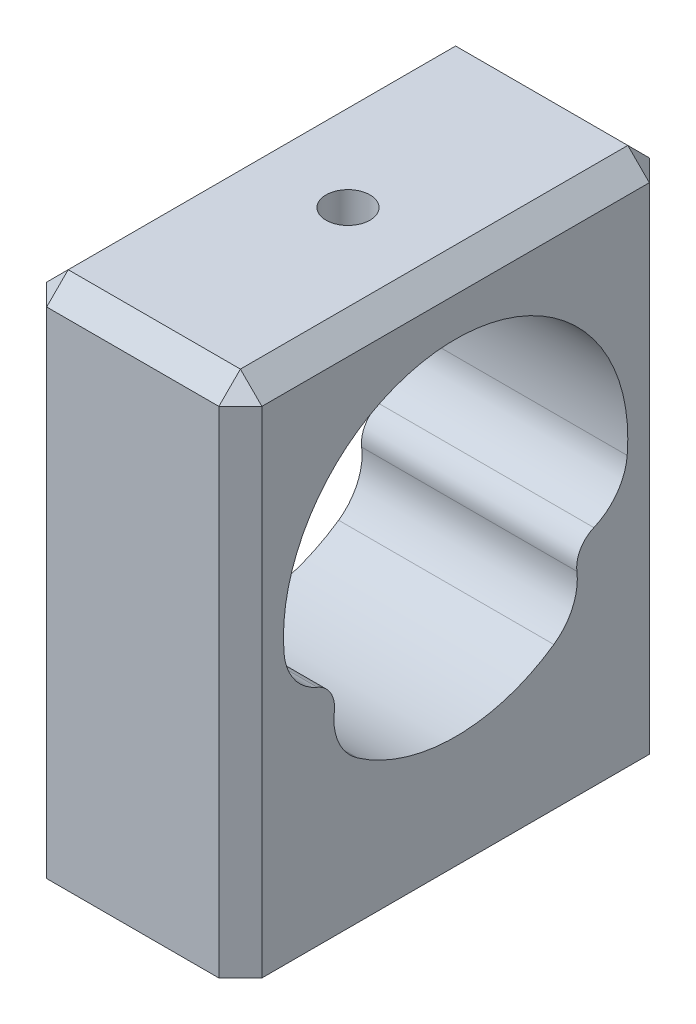
ISO-10303-21;
HEADER;
FILE_DESCRIPTION(('STEP AP214'),'2;1');
FILE_NAME('part.step','',(''),(''),'','','');
FILE_SCHEMA(('AUTOMOTIVE_DESIGN { 1 0 10303 214 1 1 1 1 }'));
ENDSEC;
DATA;
#1=APPLICATION_CONTEXT('core data for automotive mechanical design processes');
#2=APPLICATION_PROTOCOL_DEFINITION('international standard','automotive_design',2000,#1);
#3=PRODUCT_CONTEXT('',#1,'mechanical');
#4=PRODUCT('Part','Part','',(#3));
#5=PRODUCT_RELATED_PRODUCT_CATEGORY('part','',(#4));
#6=PRODUCT_DEFINITION_FORMATION('','',#4);
#7=PRODUCT_DEFINITION_CONTEXT('part definition',#1,'design');
#8=PRODUCT_DEFINITION('design','',#6,#7);
#9=PRODUCT_DEFINITION_SHAPE('','',#8);
#10=(LENGTH_UNIT() NAMED_UNIT(*) SI_UNIT(.MILLI.,.METRE.));
#11=(NAMED_UNIT(*) PLANE_ANGLE_UNIT() SI_UNIT($,.RADIAN.));
#12=(NAMED_UNIT(*) SI_UNIT($,.STERADIAN.) SOLID_ANGLE_UNIT());
#13=UNCERTAINTY_MEASURE_WITH_UNIT(LENGTH_MEASURE(1.E-05),#10,'distance_accuracy_value','');
#14=(GEOMETRIC_REPRESENTATION_CONTEXT(3) GLOBAL_UNCERTAINTY_ASSIGNED_CONTEXT((#13)) GLOBAL_UNIT_ASSIGNED_CONTEXT((#10,
#11,#12)) REPRESENTATION_CONTEXT('',''));
#15=CARTESIAN_POINT('',(0.,0.,0.));
#16=DIRECTION('',(0.,0.,1.));
#17=DIRECTION('',(1.,0.,0.));
#18=AXIS2_PLACEMENT_3D('',#15,#16,#17);
#19=CARTESIAN_POINT('',(25.,42.7979601867363,0.));
#20=DIRECTION('',(0.,-1.,0.));
#21=DIRECTION('',(0.,0.,-1.));
#22=AXIS2_PLACEMENT_3D('',#19,#20,#21);
#23=PLANE('',#22);
#24=CARTESIAN_POINT('',(12.5,42.7979601867363,0.0466317490754796));
#25=DIRECTION('',(0.,1.,0.));
#26=DIRECTION('',(0.,0.,1.));
#27=AXIS2_PLACEMENT_3D('',#24,#25,#26);
#28=CIRCLE('',#27,2.5527);
#29=CARTESIAN_POINT('',(12.5,42.7979601867363,2.59933174907548));
#30=VERTEX_POINT('',#29);
#31=EDGE_CURVE('E190',#30,#30,#28,.T.);
#32=ORIENTED_EDGE('',*,*,#31,.F.);
#33=EDGE_LOOP('',(#32));
#34=FACE_BOUND('',#33,.T.);
#35=DIRECTION('',(0.,0.,-1.));
#36=VECTOR('',#35,1.);
#37=CARTESIAN_POINT('',(22.5,42.7979601867363,-24.9533682509245));
#38=LINE('',#37,#36);
#39=CARTESIAN_POINT('',(22.5,42.7979601867363,22.5466317490755));
#40=VERTEX_POINT('',#39);
#41=CARTESIAN_POINT('',(22.5,42.7979601867363,-22.4533682509245));
#42=VERTEX_POINT('',#41);
#43=EDGE_CURVE('E343',#40,#42,#38,.T.);
#44=ORIENTED_EDGE('',*,*,#43,.T.);
#45=DIRECTION('',(-1.,0.,0.));
#46=VECTOR('',#45,1.);
#47=CARTESIAN_POINT('',(0.,42.7979601867363,-22.4533682509245));
#48=LINE('',#47,#46);
#49=CARTESIAN_POINT('',(2.5,42.7979601867363,-22.4533682509245));
#50=VERTEX_POINT('',#49);
#51=EDGE_CURVE('E11',#42,#50,#48,.T.);
#52=ORIENTED_EDGE('',*,*,#51,.T.);
#53=DIRECTION('',(0.,0.,1.));
#54=VECTOR('',#53,1.);
#55=CARTESIAN_POINT('',(2.5,42.7979601867363,0.));
#56=LINE('',#55,#54);
#57=CARTESIAN_POINT('',(2.5,42.7979601867363,22.5466317490755));
#58=VERTEX_POINT('',#57);
#59=EDGE_CURVE('E46',#50,#58,#56,.T.);
#60=ORIENTED_EDGE('',*,*,#59,.T.);
#61=DIRECTION('',(1.,0.,0.));
#62=VECTOR('',#61,1.);
#63=CARTESIAN_POINT('',(25.,42.7979601867363,22.5466317490755));
#64=LINE('',#63,#62);
#65=EDGE_CURVE('E345',#58,#40,#64,.T.);
#66=ORIENTED_EDGE('',*,*,#65,.T.);
#67=EDGE_LOOP('',(#44,#52,#60,#66));
#68=FACE_BOUND('',#67,.T.);
#69=ADVANCED_FACE('F37',(#34,#68),#23,.F.);
#70=CARTESIAN_POINT('',(25.,0.,25.0466317490755));
#71=DIRECTION('',(0.,0.,-1.));
#72=DIRECTION('',(0.,1.,0.));
#73=AXIS2_PLACEMENT_3D('',#70,#71,#72);
#74=PLANE('',#73);
#75=DIRECTION('',(-1.,0.,0.));
#76=VECTOR('',#75,1.);
#77=CARTESIAN_POINT('',(25.,40.2979601867363,25.0466317490755));
#78=LINE('',#77,#76);
#79=CARTESIAN_POINT('',(22.5,40.2979601867363,25.0466317490755));
#80=VERTEX_POINT('',#79);
#81=CARTESIAN_POINT('',(2.5,40.2979601867363,25.0466317490755));
#82=VERTEX_POINT('',#81);
#83=EDGE_CURVE('E337',#80,#82,#78,.T.);
#84=ORIENTED_EDGE('',*,*,#83,.T.);
#85=DIRECTION('',(0.,-1.,0.));
#86=VECTOR('',#85,1.);
#87=CARTESIAN_POINT('',(2.5,0.,25.0466317490755));
#88=LINE('',#87,#86);
#89=CARTESIAN_POINT('',(2.5,-17.2020398132637,25.0466317490755));
#90=VERTEX_POINT('',#89);
#91=EDGE_CURVE('E341',#82,#90,#88,.T.);
#92=ORIENTED_EDGE('',*,*,#91,.T.);
#93=DIRECTION('',(-1.,0.,0.));
#94=VECTOR('',#93,1.);
#95=CARTESIAN_POINT('',(25.,-17.2020398132637,25.0466317490755));
#96=LINE('',#95,#94);
#97=CARTESIAN_POINT('',(22.5,-17.2020398132637,25.0466317490755));
#98=VERTEX_POINT('',#97);
#99=EDGE_CURVE('E400',#98,#90,#96,.T.);
#100=ORIENTED_EDGE('',*,*,#99,.F.);
#101=DIRECTION('',(0.,1.,0.));
#102=VECTOR('',#101,1.);
#103=CARTESIAN_POINT('',(22.5,42.7979601867363,25.0466317490755));
#104=LINE('',#103,#102);
#105=EDGE_CURVE('E339',#98,#80,#104,.T.);
#106=ORIENTED_EDGE('',*,*,#105,.T.);
#107=EDGE_LOOP('',(#84,#92,#100,#106));
#108=FACE_BOUND('',#107,.T.);
#109=ADVANCED_FACE('F223',(#108),#74,.F.);
#110=CARTESIAN_POINT('',(25.,-17.2020398132637,0.));
#111=DIRECTION('',(0.,-1.,0.));
#112=DIRECTION('',(0.,0.,-1.));
#113=AXIS2_PLACEMENT_3D('',#110,#111,#112);
#114=PLANE('',#113);
#115=CARTESIAN_POINT('',(12.5,-17.2020398132637,15.0466317490755));
#116=DIRECTION('',(0.,-1.,0.));
#117=DIRECTION('',(0.,0.,-1.));
#118=AXIS2_PLACEMENT_3D('',#115,#116,#117);
#119=CIRCLE('',#118,3.17499999999999);
#120=CARTESIAN_POINT('',(12.5,-17.2020398132637,11.8716317490755));
#121=VERTEX_POINT('',#120);
#122=EDGE_CURVE('E180',#121,#121,#119,.T.);
#123=ORIENTED_EDGE('',*,*,#122,.F.);
#124=EDGE_LOOP('',(#123));
#125=FACE_BOUND('',#124,.T.);
#126=CARTESIAN_POINT('',(12.5,-17.2020398132637,-14.9533682509245));
#127=DIRECTION('',(0.,-1.,0.));
#128=DIRECTION('',(0.,0.,-1.));
#129=AXIS2_PLACEMENT_3D('',#126,#127,#128);
#130=CIRCLE('',#129,3.17499999999999);
#131=CARTESIAN_POINT('',(12.5,-17.2020398132637,-18.1283682509245));
#132=VERTEX_POINT('',#131);
#133=EDGE_CURVE('E179',#132,#132,#130,.T.);
#134=ORIENTED_EDGE('',*,*,#133,.F.);
#135=EDGE_LOOP('',(#134));
#136=FACE_BOUND('',#135,.T.);
#137=DIRECTION('',(-1.,0.,0.));
#138=VECTOR('',#137,1.);
#139=CARTESIAN_POINT('',(25.,-17.2020398132637,-24.9533682509245));
#140=LINE('',#139,#138);
#141=CARTESIAN_POINT('',(22.5,-17.2020398132637,-24.9533682509245));
#142=VERTEX_POINT('',#141);
#143=CARTESIAN_POINT('',(2.5,-17.2020398132637,-24.9533682509245));
#144=VERTEX_POINT('',#143);
#145=EDGE_CURVE('E397',#142,#144,#140,.T.);
#146=ORIENTED_EDGE('',*,*,#145,.F.);
#147=DIRECTION('',(-0.707106781186548,0.,-0.707106781186548));
#148=VECTOR('',#147,1.);
#149=CARTESIAN_POINT('',(36.2266841254623,-17.2020398132637,-11.2266841254623));
#150=LINE('',#149,#148);
#151=CARTESIAN_POINT('',(25.,-17.2020398132637,-22.4533682509245));
#152=VERTEX_POINT('',#151);
#153=EDGE_CURVE('E435',#142,#152,#150,.F.);
#154=ORIENTED_EDGE('',*,*,#153,.T.);
#155=DIRECTION('',(0.,0.,1.));
#156=VECTOR('',#155,1.);
#157=CARTESIAN_POINT('',(25.,-17.2020398132637,0.));
#158=LINE('',#157,#156);
#159=CARTESIAN_POINT('',(25.,-17.2020398132637,22.5466317490755));
#160=VERTEX_POINT('',#159);
#161=EDGE_CURVE('E377',#152,#160,#158,.T.);
#162=ORIENTED_EDGE('',*,*,#161,.T.);
#163=DIRECTION('',(-0.707106781186548,0.,0.707106781186548));
#164=VECTOR('',#163,1.);
#165=CARTESIAN_POINT('',(36.2733158745378,-17.2020398132637,11.2733158745377));
#166=LINE('',#165,#164);
#167=EDGE_CURVE('E429',#160,#98,#166,.T.);
#168=ORIENTED_EDGE('',*,*,#167,.T.);
#169=ORIENTED_EDGE('',*,*,#99,.T.);
#170=DIRECTION('',(0.707106781186548,0.,0.707106781186548));
#171=VECTOR('',#170,1.);
#172=CARTESIAN_POINT('',(1.22668412546225,-17.2020398132637,23.7733158745377));
#173=LINE('',#172,#171);
#174=CARTESIAN_POINT('',(0.,-17.2020398132637,22.5466317490755));
#175=VERTEX_POINT('',#174);
#176=EDGE_CURVE('E431',#90,#175,#173,.F.);
#177=ORIENTED_EDGE('',*,*,#176,.T.);
#178=DIRECTION('',(0.,0.,1.));
#179=VECTOR('',#178,1.);
#180=CARTESIAN_POINT('',(0.,-17.2020398132637,0.));
#181=LINE('',#180,#179);
#182=CARTESIAN_POINT('',(0.,-17.2020398132637,-22.4533682509245));
#183=VERTEX_POINT('',#182);
#184=EDGE_CURVE('E394',#183,#175,#181,.T.);
#185=ORIENTED_EDGE('',*,*,#184,.F.);
#186=DIRECTION('',(0.707106781186548,0.,-0.707106781186548));
#187=VECTOR('',#186,1.);
#188=CARTESIAN_POINT('',(1.27331587453774,-17.2020398132637,-23.7266841254623));
#189=LINE('',#188,#187);
#190=EDGE_CURVE('E433',#183,#144,#189,.T.);
#191=ORIENTED_EDGE('',*,*,#190,.T.);
#192=EDGE_LOOP('',(#146,#154,#162,#168,#169,#177,#185,#191));
#193=FACE_BOUND('',#192,.T.);
#194=ADVANCED_FACE('F229',(#125,#136,#193),#114,.T.);
#195=CARTESIAN_POINT('',(25.,14.6795696656829,-13.5558153477368));
#196=DIRECTION('',(-1.,0.,0.));
#197=DIRECTION('',(0.,0.,1.));
#198=AXIS2_PLACEMENT_3D('',#195,#196,#197);
#199=CYLINDRICAL_SURFACE('',#198,6.35);
#200=CARTESIAN_POINT('',(0.,14.6795696656829,-13.5558153477368));
#201=DIRECTION('',(1.,0.,0.));
#202=DIRECTION('',(0.,0.,-1.));
#203=AXIS2_PLACEMENT_3D('',#200,#201,#202);
#204=CIRCLE('',#203,6.35);
#205=CARTESIAN_POINT('',(0.,14.1499887273174,-19.8836936674992));
#206=VERTEX_POINT('',#205);
#207=CARTESIAN_POINT('',(0.,8.82408369364222,-16.0125986168175));
#208=VERTEX_POINT('',#207);
#209=EDGE_CURVE('E368',#206,#208,#204,.F.);
#210=ORIENTED_EDGE('',*,*,#209,.T.);
#211=DIRECTION('',(-1.,0.,0.));
#212=VECTOR('',#211,1.);
#213=CARTESIAN_POINT('',(25.,8.82408369364222,-16.0125986168175));
#214=LINE('',#213,#212);
#215=CARTESIAN_POINT('',(25.,8.82408369364222,-16.0125986168175));
#216=VERTEX_POINT('',#215);
#217=EDGE_CURVE('E401',#216,#208,#214,.T.);
#218=ORIENTED_EDGE('',*,*,#217,.F.);
#219=CARTESIAN_POINT('',(25.,14.6795696656829,-13.5558153477368));
#220=DIRECTION('',(1.,0.,0.));
#221=DIRECTION('',(0.,0.,-1.));
#222=AXIS2_PLACEMENT_3D('',#219,#220,#221);
#223=CIRCLE('',#222,6.35);
#224=CARTESIAN_POINT('',(25.,14.1499887273174,-19.8836936674992));
#225=VERTEX_POINT('',#224);
#226=EDGE_CURVE('E201',#225,#216,#223,.F.);
#227=ORIENTED_EDGE('',*,*,#226,.F.);
#228=DIRECTION('',(-1.,0.,0.));
#229=VECTOR('',#228,1.);
#230=CARTESIAN_POINT('',(25.,14.1499887273174,-19.8836936674992));
#231=LINE('',#230,#229);
#232=EDGE_CURVE('E405',#225,#206,#231,.T.);
#233=ORIENTED_EDGE('',*,*,#232,.T.);
#234=EDGE_LOOP('',(#210,#218,#227,#233));
#235=FACE_BOUND('',#234,.T.);
#236=ADVANCED_FACE('F260',(#235),#199,.F.);
#237=CARTESIAN_POINT('',(25.,5.81796018673631,-17.2738763266133));
#238=DIRECTION('',(-1.,0.,0.));
#239=DIRECTION('',(0.,0.,1.));
#240=AXIS2_PLACEMENT_3D('',#237,#238,#239);
#241=CYLINDRICAL_SURFACE('',#240,3.26);
#242=CARTESIAN_POINT('',(0.,5.81796018673631,-17.2738763266133));
#243=DIRECTION('',(1.,0.,0.));
#244=DIRECTION('',(0.,0.,-1.));
#245=AXIS2_PLACEMENT_3D('',#242,#243,#244);
#246=CIRCLE('',#245,3.26);
#247=CARTESIAN_POINT('',(0.,5.40719697119355,-14.0398581478213));
#248=VERTEX_POINT('',#247);
#249=EDGE_CURVE('E370',#208,#248,#246,.T.);
#250=ORIENTED_EDGE('',*,*,#249,.T.);
#251=DIRECTION('',(-1.,0.,0.));
#252=VECTOR('',#251,1.);
#253=CARTESIAN_POINT('',(25.,5.40719697119355,-14.0398581478213));
#254=LINE('',#253,#252);
#255=CARTESIAN_POINT('',(25.,5.40719697119355,-14.0398581478213));
#256=VERTEX_POINT('',#255);
#257=EDGE_CURVE('E418',#256,#248,#254,.T.);
#258=ORIENTED_EDGE('',*,*,#257,.F.);
#259=CARTESIAN_POINT('',(25.,5.81796018673631,-17.2738763266133));
#260=DIRECTION('',(1.,0.,0.));
#261=DIRECTION('',(0.,0.,-1.));
#262=AXIS2_PLACEMENT_3D('',#259,#260,#261);
#263=CIRCLE('',#262,3.26);
#264=EDGE_CURVE('E728',#216,#256,#263,.T.);
#265=ORIENTED_EDGE('',*,*,#264,.F.);
#266=ORIENTED_EDGE('',*,*,#217,.T.);
#267=EDGE_LOOP('',(#250,#258,#265,#266));
#268=FACE_BOUND('',#267,.T.);
#269=ADVANCED_FACE('F256',(#268),#241,.T.);
#270=CARTESIAN_POINT('',(25.,4.60709070778971,-7.74046690999034));
#271=DIRECTION('',(-1.,0.,0.));
#272=DIRECTION('',(0.,0.,1.));
#273=AXIS2_PLACEMENT_3D('',#270,#271,#272);
#274=CYLINDRICAL_SURFACE('',#273,6.35);
#275=CARTESIAN_POINT('',(0.,4.60709070778971,-7.74046690999034));
#276=DIRECTION('',(1.,0.,0.));
#277=DIRECTION('',(0.,0.,-1.));
#278=AXIS2_PLACEMENT_3D('',#275,#276,#277);
#279=CIRCLE('',#278,6.35);
#280=CARTESIAN_POINT('',(0.,-0.608222199998606,-11.3630366158561));
#281=VERTEX_POINT('',#280);
#282=EDGE_CURVE('E374',#248,#281,#279,.F.);
#283=ORIENTED_EDGE('',*,*,#282,.T.);
#284=DIRECTION('',(-1.,0.,0.));
#285=VECTOR('',#284,1.);
#286=CARTESIAN_POINT('',(25.,-0.608222199998606,-11.3630366158561));
#287=LINE('',#286,#285);
#288=CARTESIAN_POINT('',(25.,-0.608222199998606,-11.3630366158561));
#289=VERTEX_POINT('',#288);
#290=EDGE_CURVE('E416',#289,#281,#287,.T.);
#291=ORIENTED_EDGE('',*,*,#290,.F.);
#292=CARTESIAN_POINT('',(25.,4.60709070778971,-7.74046690999034));
#293=DIRECTION('',(1.,0.,0.));
#294=DIRECTION('',(0.,0.,-1.));
#295=AXIS2_PLACEMENT_3D('',#292,#293,#294);
#296=CIRCLE('',#295,6.35);
#297=EDGE_CURVE('E717',#256,#289,#296,.F.);
#298=ORIENTED_EDGE('',*,*,#297,.F.);
#299=ORIENTED_EDGE('',*,*,#257,.T.);
#300=EDGE_LOOP('',(#283,#291,#298,#299));
#301=FACE_BOUND('',#300,.T.);
#302=ADVANCED_FACE('F253',(#301),#274,.F.);
#303=CARTESIAN_POINT('',(25.,15.8179601867363,0.0466317490754875));
#304=DIRECTION('',(-1.,0.,0.));
#305=DIRECTION('',(0.,0.,1.));
#306=AXIS2_PLACEMENT_3D('',#303,#304,#305);
#307=CYLINDRICAL_SURFACE('',#306,20.);
#308=CARTESIAN_POINT('',(0.,15.8179601867363,0.0466317490754875));
#309=DIRECTION('',(1.,0.,0.));
#310=DIRECTION('',(0.,0.,-1.));
#311=AXIS2_PLACEMENT_3D('',#308,#309,#310);
#312=CIRCLE('',#311,20.);
#313=CARTESIAN_POINT('',(0.,-0.608222199998613,11.4563001140071));
#314=VERTEX_POINT('',#313);
#315=EDGE_CURVE('E382',#314,#281,#312,.T.);
#316=ORIENTED_EDGE('',*,*,#315,.F.);
#317=DIRECTION('',(-1.,0.,0.));
#318=VECTOR('',#317,1.);
#319=CARTESIAN_POINT('',(25.,-0.608222199998613,11.4563001140071));
#320=LINE('',#319,#318);
#321=CARTESIAN_POINT('',(25.,-0.608222199998613,11.4563001140071));
#322=VERTEX_POINT('',#321);
#323=EDGE_CURVE('E414',#322,#314,#320,.T.);
#324=ORIENTED_EDGE('',*,*,#323,.F.);
#325=CARTESIAN_POINT('',(25.,15.8179601867363,0.0466317490754875));
#326=DIRECTION('',(1.,0.,0.));
#327=DIRECTION('',(0.,0.,-1.));
#328=AXIS2_PLACEMENT_3D('',#325,#326,#327);
#329=CIRCLE('',#328,20.);
#330=EDGE_CURVE('E713',#322,#289,#329,.T.);
#331=ORIENTED_EDGE('',*,*,#330,.T.);
#332=ORIENTED_EDGE('',*,*,#290,.T.);
#333=EDGE_LOOP('',(#316,#324,#331,#332));
#334=FACE_BOUND('',#333,.T.);
#335=ADVANCED_FACE('F241',(#334),#307,.F.);
#336=CARTESIAN_POINT('',(25.,4.60709070778971,7.8337304081413));
#337=DIRECTION('',(-1.,0.,0.));
#338=DIRECTION('',(0.,0.,1.));
#339=AXIS2_PLACEMENT_3D('',#336,#337,#338);
#340=CYLINDRICAL_SURFACE('',#339,6.35);
#341=CARTESIAN_POINT('',(0.,4.60709070778971,7.8337304081413));
#342=DIRECTION('',(1.,0.,0.));
#343=DIRECTION('',(0.,0.,-1.));
#344=AXIS2_PLACEMENT_3D('',#341,#342,#343);
#345=CIRCLE('',#344,6.35);
#346=CARTESIAN_POINT('',(0.,5.40719697119354,14.1331216459723));
#347=VERTEX_POINT('',#346);
#348=EDGE_CURVE('E385',#347,#314,#345,.T.);
#349=ORIENTED_EDGE('',*,*,#348,.F.);
#350=DIRECTION('',(-1.,0.,0.));
#351=VECTOR('',#350,1.);
#352=CARTESIAN_POINT('',(25.,5.40719697119354,14.1331216459723));
#353=LINE('',#352,#351);
#354=CARTESIAN_POINT('',(25.,5.40719697119354,14.1331216459723));
#355=VERTEX_POINT('',#354);
#356=EDGE_CURVE('E412',#355,#347,#353,.T.);
#357=ORIENTED_EDGE('',*,*,#356,.F.);
#358=CARTESIAN_POINT('',(25.,4.60709070778971,7.8337304081413));
#359=DIRECTION('',(1.,0.,0.));
#360=DIRECTION('',(0.,0.,-1.));
#361=AXIS2_PLACEMENT_3D('',#358,#359,#360);
#362=CIRCLE('',#361,6.35);
#363=EDGE_CURVE('E711',#355,#322,#362,.T.);
#364=ORIENTED_EDGE('',*,*,#363,.T.);
#365=ORIENTED_EDGE('',*,*,#323,.T.);
#366=EDGE_LOOP('',(#349,#357,#364,#365));
#367=FACE_BOUND('',#366,.T.);
#368=ADVANCED_FACE('F248',(#367),#340,.F.);
#369=CARTESIAN_POINT('',(25.,5.8179601867363,17.3671398247643));
#370=DIRECTION('',(-1.,0.,0.));
#371=DIRECTION('',(0.,0.,1.));
#372=AXIS2_PLACEMENT_3D('',#369,#370,#371);
#373=CYLINDRICAL_SURFACE('',#372,3.26);
#374=CARTESIAN_POINT('',(0.,5.8179601867363,17.3671398247643));
#375=DIRECTION('',(1.,0.,0.));
#376=DIRECTION('',(0.,0.,-1.));
#377=AXIS2_PLACEMENT_3D('',#374,#375,#376);
#378=CIRCLE('',#377,3.26);
#379=CARTESIAN_POINT('',(0.,8.82408369364221,16.1058621149685));
#380=VERTEX_POINT('',#379);
#381=EDGE_CURVE('E389',#347,#380,#378,.T.);
#382=ORIENTED_EDGE('',*,*,#381,.T.);
#383=DIRECTION('',(-1.,0.,0.));
#384=VECTOR('',#383,1.);
#385=CARTESIAN_POINT('',(25.,8.82408369364221,16.1058621149685));
#386=LINE('',#385,#384);
#387=CARTESIAN_POINT('',(25.,8.82408369364221,16.1058621149685));
#388=VERTEX_POINT('',#387);
#389=EDGE_CURVE('E409',#388,#380,#386,.T.);
#390=ORIENTED_EDGE('',*,*,#389,.F.);
#391=CARTESIAN_POINT('',(25.,5.8179601867363,17.3671398247643));
#392=DIRECTION('',(1.,0.,0.));
#393=DIRECTION('',(0.,0.,-1.));
#394=AXIS2_PLACEMENT_3D('',#391,#392,#393);
#395=CIRCLE('',#394,3.26);
#396=EDGE_CURVE('E712',#355,#388,#395,.T.);
#397=ORIENTED_EDGE('',*,*,#396,.F.);
#398=ORIENTED_EDGE('',*,*,#356,.T.);
#399=EDGE_LOOP('',(#382,#390,#397,#398));
#400=FACE_BOUND('',#399,.T.);
#401=ADVANCED_FACE('F244',(#400),#373,.T.);
#402=CARTESIAN_POINT('',(25.,14.6795696656829,13.6490788458877));
#403=DIRECTION('',(-1.,0.,0.));
#404=DIRECTION('',(0.,0.,1.));
#405=AXIS2_PLACEMENT_3D('',#402,#403,#404);
#406=CYLINDRICAL_SURFACE('',#405,6.35);
#407=CARTESIAN_POINT('',(0.,14.6795696656829,13.6490788458877));
#408=DIRECTION('',(1.,0.,0.));
#409=DIRECTION('',(0.,0.,-1.));
#410=AXIS2_PLACEMENT_3D('',#407,#408,#409);
#411=CIRCLE('',#410,6.35);
#412=CARTESIAN_POINT('',(0.,14.1499887273174,19.9769571656502));
#413=VERTEX_POINT('',#412);
#414=EDGE_CURVE('E391',#380,#413,#411,.F.);
#415=ORIENTED_EDGE('',*,*,#414,.T.);
#416=DIRECTION('',(-1.,0.,0.));
#417=VECTOR('',#416,1.);
#418=CARTESIAN_POINT('',(25.,14.1499887273174,19.9769571656502));
#419=LINE('',#418,#417);
#420=CARTESIAN_POINT('',(25.,14.1499887273174,19.9769571656502));
#421=VERTEX_POINT('',#420);
#422=EDGE_CURVE('E407',#421,#413,#419,.T.);
#423=ORIENTED_EDGE('',*,*,#422,.F.);
#424=CARTESIAN_POINT('',(25.,14.6795696656829,13.6490788458877));
#425=DIRECTION('',(1.,0.,0.));
#426=DIRECTION('',(0.,0.,-1.));
#427=AXIS2_PLACEMENT_3D('',#424,#425,#426);
#428=CIRCLE('',#427,6.35);
#429=EDGE_CURVE('E715',#388,#421,#428,.F.);
#430=ORIENTED_EDGE('',*,*,#429,.F.);
#431=ORIENTED_EDGE('',*,*,#389,.T.);
#432=EDGE_LOOP('',(#415,#423,#430,#431));
#433=FACE_BOUND('',#432,.T.);
#434=ADVANCED_FACE('F239',(#433),#406,.F.);
#435=CARTESIAN_POINT('',(12.5,35.6543843279468,2.59933174907548));
#436=CARTESIAN_POINT('',(12.3572416838352,35.6543864160402,2.59932569481596));
#437=CARTESIAN_POINT('',(12.2143947575747,35.6559420702071,2.5873158129562));
#438=CARTESIAN_POINT('',(11.9326781380449,35.6619940707854,2.53959691605681));
#439=CARTESIAN_POINT('',(11.7938127303045,35.6664934701941,2.50386329624642));
#440=CARTESIAN_POINT('',(11.5241786303058,35.6779152137445,2.40976907951242));
#441=CARTESIAN_POINT('',(11.3934044447206,35.6848358922985,2.35142403392923));
#442=CARTESIAN_POINT('',(11.1435269886496,35.7003184060576,2.21379679800134));
#443=CARTESIAN_POINT('',(11.0244217654798,35.7088799659663,2.13451811892368));
#444=CARTESIAN_POINT('',(10.8005450839868,35.7267354538854,1.9567791697767));
#445=CARTESIAN_POINT('',(10.6958514950218,35.73603296338,1.85822116572775));
#446=CARTESIAN_POINT('',(10.5044428003175,35.7542805718876,1.64493173210829));
#447=CARTESIAN_POINT('',(10.4177285978291,35.763230653428,1.53019949046038));
#448=CARTESIAN_POINT('',(10.2644600135495,35.7798117136507,1.28732798270043));
#449=CARTESIAN_POINT('',(10.1979762357245,35.787438033538,1.15914381551506));
#450=CARTESIAN_POINT('',(10.0875080387419,35.80047289575,0.893316108177442));
#451=CARTESIAN_POINT('',(10.043522750441,35.8058815237451,0.755672933670965));
#452=CARTESIAN_POINT('',(9.97953313079223,35.8138463682097,0.475631432445426));
#453=CARTESIAN_POINT('',(9.95939922671489,35.8164179914227,0.333263158367532));
#454=CARTESIAN_POINT('',(9.94328226400126,35.8184717040898,0.0471469487521629));
#455=CARTESIAN_POINT('',(9.94729821712445,35.8179539199661,-0.0966009300899311));
#456=CARTESIAN_POINT('',(9.97926328320534,35.8138996087693,-0.38051406505626));
#457=CARTESIAN_POINT('',(10.0070730394015,35.8103806594565,-0.520695297363489));
#458=CARTESIAN_POINT('',(10.0856183639764,35.8007391319719,-0.794384734157456));
#459=CARTESIAN_POINT('',(10.1363543838085,35.7946165025297,-0.927892807181938));
#460=CARTESIAN_POINT('',(10.2594596823029,35.780425281213,-1.18487660673625));
#461=CARTESIAN_POINT('',(10.3318891087609,35.7723512911127,-1.30832320990767));
#462=CARTESIAN_POINT('',(10.4962814451631,35.7551603238336,-1.54136219279759));
#463=CARTESIAN_POINT('',(10.588245288962,35.7460432968013,-1.65095390977509));
#464=CARTESIAN_POINT('',(10.7898760567982,35.7277095435735,-1.85399120044943));
#465=CARTESIAN_POINT('',(10.8996644538134,35.7184925698661,-1.94731616167771));
#466=CARTESIAN_POINT('',(11.1334109987325,35.7010617769836,-2.11423295805381));
#467=CARTESIAN_POINT('',(11.2573691945326,35.6928479611995,-2.18782472649748));
#468=CARTESIAN_POINT('',(11.5160458577234,35.678353604002,-2.31319394272881));
#469=CARTESIAN_POINT('',(11.6507691886575,35.6720739427043,-2.36496146357091));
#470=CARTESIAN_POINT('',(11.9270947856339,35.662175888705,-2.44510434443558));
#471=CARTESIAN_POINT('',(12.0686967051427,35.6585573620871,-2.47348088157168));
#472=CARTESIAN_POINT('',(12.3536939162928,35.6544158551712,-2.50587600625001));
#473=CARTESIAN_POINT('',(12.4970695985099,35.6538712888565,-2.51006445262583));
#474=CARTESIAN_POINT('',(12.7824784792897,35.6558822497009,-2.49441292457495));
#475=CARTESIAN_POINT('',(12.924511707647,35.6584377078939,-2.47457348469537));
#476=CARTESIAN_POINT('',(13.2026931849448,35.666341071556,-2.41157247330073));
#477=CARTESIAN_POINT('',(13.3388604181787,35.6716790992523,-2.36849338088118));
#478=CARTESIAN_POINT('',(13.6020389878373,35.6845381181353,-2.26032091107954));
#479=CARTESIAN_POINT('',(13.7290499894332,35.6920591891018,-2.1952267291359));
#480=CARTESIAN_POINT('',(13.9710785302592,35.7084884828329,-2.04445516238085));
#481=CARTESIAN_POINT('',(14.0860262553728,35.7174041081982,-1.95866652719721));
#482=CARTESIAN_POINT('',(14.2999524482009,35.7355947948682,-1.76909828900279));
#483=CARTESIAN_POINT('',(14.3989302674236,35.7448698707502,-1.66531795575592));
#484=CARTESIAN_POINT('',(14.5787050120353,35.7628008117464,-1.44196966246262));
#485=CARTESIAN_POINT('',(14.6593902294864,35.7714526631571,-1.32231141940448));
#486=CARTESIAN_POINT('',(14.7995159492519,35.7871020817889,-1.07104223216181));
#487=CARTESIAN_POINT('',(14.8589568953103,35.7940996835624,-0.939431537708527));
#488=CARTESIAN_POINT('',(14.9547228726095,35.8056343694458,-0.668362405468719));
#489=CARTESIAN_POINT('',(14.9911121235313,35.8101782840137,-0.528926958547922));
#490=CARTESIAN_POINT('',(15.0399505698029,35.8163220135643,-0.245863306580565));
#491=CARTESIAN_POINT('',(15.0524008930496,35.8179219672534,-0.1022352993927));
#492=CARTESIAN_POINT('',(15.0529863621073,35.8179967792272,0.184046378101164));
#493=CARTESIAN_POINT('',(15.0412936252332,35.8164937588103,0.326699721178873));
#494=CARTESIAN_POINT('',(14.9942898501224,35.8105755326181,0.607996021855116));
#495=CARTESIAN_POINT('',(14.9589788332732,35.8061603294799,0.746638983085114));
#496=CARTESIAN_POINT('',(14.8657955999484,35.7949116033192,1.01595397038597));
#497=CARTESIAN_POINT('',(14.8079319911437,35.7880790030387,1.14662901560033));
#498=CARTESIAN_POINT('',(14.6713039594966,35.7727514586304,1.3964415073055));
#499=CARTESIAN_POINT('',(14.5925392454063,35.7642564913388,1.51557879299101));
#500=CARTESIAN_POINT('',(14.4157093451146,35.7464798382693,1.73981268243374));
#501=CARTESIAN_POINT('',(14.3175161616763,35.7371931810314,1.84480796025821));
#502=CARTESIAN_POINT('',(14.1048831514595,35.718919405842,2.03689744736339));
#503=CARTESIAN_POINT('',(13.9904394864284,35.7099323592774,2.12398741560262));
#504=CARTESIAN_POINT('',(13.748024142054,35.6932367718221,2.27809570077892));
#505=CARTESIAN_POINT('',(13.6199998676877,35.6855335223865,2.34503182034493));
#506=CARTESIAN_POINT('',(13.3544997585376,35.6723397169244,2.45635874255538));
#507=CARTESIAN_POINT('',(13.2170343422268,35.6668467663014,2.50077395757705));
#508=CARTESIAN_POINT('',(12.9823884171539,35.6600230072519,2.55521809512678));
#509=CARTESIAN_POINT('',(12.8866852474625,35.6579190981779,2.57173678147051));
#510=CARTESIAN_POINT('',(12.6940016874741,35.6550990545534,2.59379562157866));
#511=CARTESIAN_POINT('',(12.5970213074588,35.6543829088382,2.59933586366711));
#512=CARTESIAN_POINT('',(12.5,35.6543843279468,2.59933174907548));
#513=B_SPLINE_CURVE_WITH_KNOTS('',3,(#435,#436,#437,#438,#439,#440,#441,#442,#443,#444,#445,
#446,#447,#448,#449,#450,#451,#452,#453,#454,#455,#456,#457,#458,#459,#460,#461,#462,#463,#464,
#465,#466,#467,#468,#469,#470,#471,#472,#473,#474,#475,#476,#477,#478,#479,#480,#481,#482,#483,
#484,#485,#486,#487,#488,#489,#490,#491,#492,#493,#494,#495,#496,#497,#498,#499,#500,#501,#502,
#503,#504,#505,#506,#507,#508,#509,#510,#511,#512),.UNSPECIFIED.,.T.,.F.,(4,2,2,2,2,2,2,2,2,2,2,
2,2,2,2,2,2,2,2,2,2,2,2,2,2,2,2,2,2,2,2,2,2,2,2,2,2,2,4),(0.,0.427920495817666,
0.856285498656758,1.28435640851927,1.71235556220394,2.14258342187768,2.57283289016431,
3.00456714336972,3.4362847169076,3.86564606818972,4.29498984962056,4.72183610817693,
5.14869077235819,5.57674007859641,6.00480985260089,6.43592981002201,6.86705122474017,
7.29836852769152,7.72966412396981,8.15792726501564,8.58618087868894,9.01292449563774,
9.43968371000753,9.86879035471947,10.2979144198296,10.7295923839857,11.1612613308546,
11.5917223410101,12.0221630692405,12.449545757114,12.8769280579737,13.3041473988761,
13.7313726932093,14.1615124036642,14.5917538796893,15.0237270375294,15.4552309354597,
15.7460563047192,16.0368793342142),.UNSPECIFIED.);
#514=CARTESIAN_POINT('',(12.5,35.6543843279468,2.59933174907548));
#515=VERTEX_POINT('',#514);
#516=EDGE_CURVE('E193',#515,#515,#513,.T.);
#517=ORIENTED_EDGE('',*,*,#516,.F.);
#518=EDGE_LOOP('',(#517));
#519=FACE_BOUND('',#518,.T.);
#520=EDGE_CURVE('E386',#206,#413,#312,.T.);
#521=ORIENTED_EDGE('',*,*,#520,.F.);
#522=ORIENTED_EDGE('',*,*,#232,.F.);
#523=EDGE_CURVE('E451',#225,#421,#329,.T.);
#524=ORIENTED_EDGE('',*,*,#523,.T.);
#525=ORIENTED_EDGE('',*,*,#422,.T.);
#526=EDGE_LOOP('',(#521,#522,#524,#525));
#527=FACE_BOUND('',#526,.T.);
#528=ADVANCED_FACE('F235',(#519,#527),#307,.F.);
#529=CARTESIAN_POINT('',(25.,0.,-24.9533682509245));
#530=DIRECTION('',(0.,0.,-1.));
#531=DIRECTION('',(0.,1.,0.));
#532=AXIS2_PLACEMENT_3D('',#529,#530,#531);
#533=PLANE('',#532);
#534=DIRECTION('',(1.,0.,0.));
#535=VECTOR('',#534,1.);
#536=CARTESIAN_POINT('',(25.,40.2979601867363,-24.9533682509245));
#537=LINE('',#536,#535);
#538=CARTESIAN_POINT('',(2.5,40.2979601867363,-24.9533682509245));
#539=VERTEX_POINT('',#538);
#540=CARTESIAN_POINT('',(22.5,40.2979601867363,-24.9533682509245));
#541=VERTEX_POINT('',#540);
#542=EDGE_CURVE('E404',#539,#541,#537,.T.);
#543=ORIENTED_EDGE('',*,*,#542,.T.);
#544=DIRECTION('',(0.,-1.,0.));
#545=VECTOR('',#544,1.);
#546=CARTESIAN_POINT('',(22.5,0.,-24.9533682509245));
#547=LINE('',#546,#545);
#548=EDGE_CURVE('E426',#541,#142,#547,.T.);
#549=ORIENTED_EDGE('',*,*,#548,.T.);
#550=ORIENTED_EDGE('',*,*,#145,.T.);
#551=DIRECTION('',(0.,1.,0.));
#552=VECTOR('',#551,1.);
#553=CARTESIAN_POINT('',(2.5,42.7979601867363,-24.9533682509245));
#554=LINE('',#553,#552);
#555=EDGE_CURVE('E424',#144,#539,#554,.T.);
#556=ORIENTED_EDGE('',*,*,#555,.T.);
#557=EDGE_LOOP('',(#543,#549,#550,#556));
#558=FACE_BOUND('',#557,.T.);
#559=ADVANCED_FACE('F238',(#558),#533,.T.);
#560=CARTESIAN_POINT('',(25.,0.,0.));
#561=DIRECTION('',(1.,0.,0.));
#562=DIRECTION('',(0.,0.,-1.));
#563=AXIS2_PLACEMENT_3D('',#560,#561,#562);
#564=PLANE('',#563);
#565=ORIENTED_EDGE('',*,*,#161,.F.);
#566=DIRECTION('',(0.,1.,0.));
#567=VECTOR('',#566,1.);
#568=CARTESIAN_POINT('',(25.,0.,-22.4533682509245));
#569=LINE('',#568,#567);
#570=CARTESIAN_POINT('',(25.,40.2979601867363,-22.4533682509245));
#571=VERTEX_POINT('',#570);
#572=EDGE_CURVE('E328',#152,#571,#569,.T.);
#573=ORIENTED_EDGE('',*,*,#572,.T.);
#574=DIRECTION('',(0.,0.,1.));
#575=VECTOR('',#574,1.);
#576=CARTESIAN_POINT('',(25.,40.2979601867363,25.0466317490755));
#577=LINE('',#576,#575);
#578=CARTESIAN_POINT('',(25.,40.2979601867363,22.5466317490755));
#579=VERTEX_POINT('',#578);
#580=EDGE_CURVE('E437',#571,#579,#577,.T.);
#581=ORIENTED_EDGE('',*,*,#580,.T.);
#582=DIRECTION('',(0.,-1.,0.));
#583=VECTOR('',#582,1.);
#584=CARTESIAN_POINT('',(25.,-17.2020398132637,22.5466317490755));
#585=LINE('',#584,#583);
#586=EDGE_CURVE('E332',#579,#160,#585,.T.);
#587=ORIENTED_EDGE('',*,*,#586,.T.);
#588=EDGE_LOOP('',(#565,#573,#581,#587));
#589=FACE_BOUND('',#588,.T.);
#590=ORIENTED_EDGE('',*,*,#226,.T.);
#591=ORIENTED_EDGE('',*,*,#264,.T.);
#592=ORIENTED_EDGE('',*,*,#297,.T.);
#593=ORIENTED_EDGE('',*,*,#330,.F.);
#594=ORIENTED_EDGE('',*,*,#363,.F.);
#595=ORIENTED_EDGE('',*,*,#396,.T.);
#596=ORIENTED_EDGE('',*,*,#429,.T.);
#597=ORIENTED_EDGE('',*,*,#523,.F.);
#598=EDGE_LOOP('',(#590,#591,#592,#593,#594,#595,#596,#597));
#599=FACE_BOUND('',#598,.T.);
#600=ADVANCED_FACE('F442',(#589,#599),#564,.T.);
#601=CARTESIAN_POINT('',(0.,0.,0.));
#602=DIRECTION('',(1.,0.,0.));
#603=DIRECTION('',(0.,0.,-1.));
#604=AXIS2_PLACEMENT_3D('',#601,#602,#603);
#605=PLANE('',#604);
#606=ORIENTED_EDGE('',*,*,#209,.F.);
#607=ORIENTED_EDGE('',*,*,#520,.T.);
#608=ORIENTED_EDGE('',*,*,#414,.F.);
#609=ORIENTED_EDGE('',*,*,#381,.F.);
#610=ORIENTED_EDGE('',*,*,#348,.T.);
#611=ORIENTED_EDGE('',*,*,#315,.T.);
#612=ORIENTED_EDGE('',*,*,#282,.F.);
#613=ORIENTED_EDGE('',*,*,#249,.F.);
#614=EDGE_LOOP('',(#606,#607,#608,#609,#610,#611,#612,#613));
#615=FACE_BOUND('',#614,.T.);
#616=DIRECTION('',(0.,0.,-1.));
#617=VECTOR('',#616,1.);
#618=CARTESIAN_POINT('',(0.,40.2979601867363,0.));
#619=LINE('',#618,#617);
#620=CARTESIAN_POINT('',(0.,40.2979601867363,22.5466317490755));
#621=VERTEX_POINT('',#620);
#622=CARTESIAN_POINT('',(0.,40.2979601867363,-22.4533682509245));
#623=VERTEX_POINT('',#622);
#624=EDGE_CURVE('E322',#621,#623,#619,.T.);
#625=ORIENTED_EDGE('',*,*,#624,.T.);
#626=DIRECTION('',(0.,-1.,0.));
#627=VECTOR('',#626,1.);
#628=CARTESIAN_POINT('',(0.,-17.2020398132637,-22.4533682509245));
#629=LINE('',#628,#627);
#630=EDGE_CURVE('E330',#623,#183,#629,.T.);
#631=ORIENTED_EDGE('',*,*,#630,.T.);
#632=ORIENTED_EDGE('',*,*,#184,.T.);
#633=DIRECTION('',(0.,1.,0.));
#634=VECTOR('',#633,1.);
#635=CARTESIAN_POINT('',(0.,0.,22.5466317490755));
#636=LINE('',#635,#634);
#637=EDGE_CURVE('E327',#175,#621,#636,.T.);
#638=ORIENTED_EDGE('',*,*,#637,.T.);
#639=EDGE_LOOP('',(#625,#631,#632,#638));
#640=FACE_BOUND('',#639,.T.);
#641=ADVANCED_FACE('F308',(#615,#640),#605,.F.);
#642=CARTESIAN_POINT('',(2.5,0.,25.0466317490755));
#643=DIRECTION('',(0.707106781186547,0.,-0.707106781186547));
#644=DIRECTION('',(0.,-1.,0.));
#645=AXIS2_PLACEMENT_3D('',#642,#643,#644);
#646=PLANE('',#645);
#647=DIRECTION('',(-0.707106781186548,0.,-0.707106781186548));
#648=VECTOR('',#647,1.);
#649=CARTESIAN_POINT('',(0.,40.2979601867363,22.5466317490755));
#650=LINE('',#649,#648);
#651=EDGE_CURVE('E41',#621,#82,#650,.F.);
#652=ORIENTED_EDGE('',*,*,#651,.F.);
#653=ORIENTED_EDGE('',*,*,#637,.F.);
#654=ORIENTED_EDGE('',*,*,#176,.F.);
#655=ORIENTED_EDGE('',*,*,#91,.F.);
#656=EDGE_LOOP('',(#652,#653,#654,#655));
#657=FACE_BOUND('',#656,.T.);
#658=ADVANCED_FACE('F39',(#657),#646,.F.);
#659=CARTESIAN_POINT('',(0.,40.2979601867363,22.5466317490755));
#660=DIRECTION('',(-0.577350269189627,0.577350269189625,0.577350269189626));
#661=DIRECTION('',(0.707106781186546,0.,0.707106781186548));
#662=AXIS2_PLACEMENT_3D('',#659,#660,#661);
#663=PLANE('',#662);
#664=DIRECTION('',(0.707106781186547,0.707106781186547,0.));
#665=VECTOR('',#664,1.);
#666=CARTESIAN_POINT('',(0.,40.2979601867363,22.5466317490755));
#667=LINE('',#666,#665);
#668=EDGE_CURVE('E313',#621,#58,#667,.T.);
#669=ORIENTED_EDGE('',*,*,#668,.F.);
#670=ORIENTED_EDGE('',*,*,#651,.T.);
#671=DIRECTION('',(0.,-0.707106781186548,0.707106781186548));
#672=VECTOR('',#671,1.);
#673=CARTESIAN_POINT('',(2.5,41.5479601867363,23.7966317490755));
#674=LINE('',#673,#672);
#675=EDGE_CURVE('E317',#58,#82,#674,.T.);
#676=ORIENTED_EDGE('',*,*,#675,.F.);
#677=EDGE_LOOP('',(#669,#670,#676));
#678=FACE_BOUND('',#677,.T.);
#679=ADVANCED_FACE('F301',(#678),#663,.T.);
#680=CARTESIAN_POINT('',(25.,0.,22.5466317490755));
#681=DIRECTION('',(0.707106781186547,0.,0.707106781186547));
#682=DIRECTION('',(0.,1.,0.));
#683=AXIS2_PLACEMENT_3D('',#680,#681,#682);
#684=PLANE('',#683);
#685=ORIENTED_EDGE('',*,*,#167,.F.);
#686=ORIENTED_EDGE('',*,*,#586,.F.);
#687=DIRECTION('',(0.707106781186548,0.,-0.707106781186548));
#688=VECTOR('',#687,1.);
#689=CARTESIAN_POINT('',(22.5,40.2979601867363,25.0466317490755));
#690=LINE('',#689,#688);
#691=EDGE_CURVE('E319',#80,#579,#690,.T.);
#692=ORIENTED_EDGE('',*,*,#691,.F.);
#693=ORIENTED_EDGE('',*,*,#105,.F.);
#694=EDGE_LOOP('',(#685,#686,#692,#693));
#695=FACE_BOUND('',#694,.T.);
#696=ADVANCED_FACE('F298',(#695),#684,.T.);
#697=CARTESIAN_POINT('',(25.,40.2979601867363,25.0466317490755));
#698=DIRECTION('',(0.,-0.707106781186547,-0.707106781186547));
#699=DIRECTION('',(-1.,0.,0.));
#700=AXIS2_PLACEMENT_3D('',#697,#698,#699);
#701=PLANE('',#700);
#702=ORIENTED_EDGE('',*,*,#675,.T.);
#703=ORIENTED_EDGE('',*,*,#83,.F.);
#704=DIRECTION('',(0.,0.707106781186548,-0.707106781186548));
#705=VECTOR('',#704,1.);
#706=CARTESIAN_POINT('',(22.5,40.2979601867363,25.0466317490755));
#707=LINE('',#706,#705);
#708=EDGE_CURVE('E363',#40,#80,#707,.F.);
#709=ORIENTED_EDGE('',*,*,#708,.F.);
#710=ORIENTED_EDGE('',*,*,#65,.F.);
#711=EDGE_LOOP('',(#702,#703,#709,#710));
#712=FACE_BOUND('',#711,.T.);
#713=ADVANCED_FACE('F294',(#712),#701,.F.);
#714=CARTESIAN_POINT('',(2.5,42.7979601867363,0.));
#715=DIRECTION('',(0.707106781186547,-0.707106781186547,0.));
#716=DIRECTION('',(0.,0.,1.));
#717=AXIS2_PLACEMENT_3D('',#714,#715,#716);
#718=PLANE('',#717);
#719=ORIENTED_EDGE('',*,*,#668,.T.);
#720=ORIENTED_EDGE('',*,*,#59,.F.);
#721=DIRECTION('',(-0.707106781186548,-0.707106781186548,0.));
#722=VECTOR('',#721,1.);
#723=CARTESIAN_POINT('',(1.24999999999999,41.5479601867363,-22.4533682509245));
#724=LINE('',#723,#722);
#725=EDGE_CURVE('E323',#623,#50,#724,.F.);
#726=ORIENTED_EDGE('',*,*,#725,.F.);
#727=ORIENTED_EDGE('',*,*,#624,.F.);
#728=EDGE_LOOP('',(#719,#720,#726,#727));
#729=FACE_BOUND('',#728,.T.);
#730=ADVANCED_FACE('F290',(#729),#718,.F.);
#731=CARTESIAN_POINT('',(0.,0.,-22.4533682509245));
#732=DIRECTION('',(-0.707106781186547,0.,-0.707106781186547));
#733=DIRECTION('',(0.,1.,0.));
#734=AXIS2_PLACEMENT_3D('',#731,#732,#733);
#735=PLANE('',#734);
#736=ORIENTED_EDGE('',*,*,#190,.F.);
#737=ORIENTED_EDGE('',*,*,#630,.F.);
#738=DIRECTION('',(-0.707106781186548,0.,0.707106781186548));
#739=VECTOR('',#738,1.);
#740=CARTESIAN_POINT('',(2.5,40.2979601867363,-24.9533682509245));
#741=LINE('',#740,#739);
#742=EDGE_CURVE('E360',#539,#623,#741,.T.);
#743=ORIENTED_EDGE('',*,*,#742,.F.);
#744=ORIENTED_EDGE('',*,*,#555,.F.);
#745=EDGE_LOOP('',(#736,#737,#743,#744));
#746=FACE_BOUND('',#745,.T.);
#747=ADVANCED_FACE('F286',(#746),#735,.T.);
#748=CARTESIAN_POINT('',(22.5,40.2979601867363,25.0466317490755));
#749=DIRECTION('',(0.577350269189627,0.577350269189625,0.577350269189626));
#750=DIRECTION('',(0.707106781186546,0.,-0.707106781186548));
#751=AXIS2_PLACEMENT_3D('',#748,#749,#750);
#752=PLANE('',#751);
#753=ORIENTED_EDGE('',*,*,#708,.T.);
#754=ORIENTED_EDGE('',*,*,#691,.T.);
#755=DIRECTION('',(-0.707106781186547,0.707106781186547,0.));
#756=VECTOR('',#755,1.);
#757=CARTESIAN_POINT('',(23.75,41.5479601867363,22.5466317490755));
#758=LINE('',#757,#756);
#759=EDGE_CURVE('E357',#40,#579,#758,.F.);
#760=ORIENTED_EDGE('',*,*,#759,.F.);
#761=EDGE_LOOP('',(#753,#754,#760));
#762=FACE_BOUND('',#761,.T.);
#763=ADVANCED_FACE('F282',(#762),#752,.T.);
#764=CARTESIAN_POINT('',(2.5,40.2979601867363,-24.9533682509245));
#765=DIRECTION('',(-0.577350269189625,0.577350269189626,-0.577350269189627));
#766=DIRECTION('',(0.,0.707106781186548,0.707106781186547));
#767=AXIS2_PLACEMENT_3D('',#764,#765,#766);
#768=PLANE('',#767);
#769=ORIENTED_EDGE('',*,*,#742,.T.);
#770=ORIENTED_EDGE('',*,*,#725,.T.);
#771=DIRECTION('',(0.,-0.707106781186548,-0.707106781186546));
#772=VECTOR('',#771,1.);
#773=CARTESIAN_POINT('',(2.5,40.2979601867363,-24.9533682509245));
#774=LINE('',#773,#772);
#775=EDGE_CURVE('E54',#539,#50,#774,.F.);
#776=ORIENTED_EDGE('',*,*,#775,.F.);
#777=EDGE_LOOP('',(#769,#770,#776));
#778=FACE_BOUND('',#777,.T.);
#779=ADVANCED_FACE('F278',(#778),#768,.T.);
#780=CARTESIAN_POINT('',(25.,40.2979601867363,0.));
#781=DIRECTION('',(0.707106781186547,0.707106781186547,0.));
#782=DIRECTION('',(0.,0.,-1.));
#783=AXIS2_PLACEMENT_3D('',#780,#781,#782);
#784=PLANE('',#783);
#785=ORIENTED_EDGE('',*,*,#759,.T.);
#786=ORIENTED_EDGE('',*,*,#580,.F.);
#787=DIRECTION('',(0.707106781186548,-0.707106781186548,0.));
#788=VECTOR('',#787,1.);
#789=CARTESIAN_POINT('',(25.,40.2979601867363,-22.4533682509245));
#790=LINE('',#789,#788);
#791=EDGE_CURVE('E353',#42,#571,#790,.T.);
#792=ORIENTED_EDGE('',*,*,#791,.F.);
#793=ORIENTED_EDGE('',*,*,#43,.F.);
#794=EDGE_LOOP('',(#785,#786,#792,#793));
#795=FACE_BOUND('',#794,.T.);
#796=ADVANCED_FACE('F275',(#795),#784,.T.);
#797=CARTESIAN_POINT('',(25.,42.7979601867363,-22.4533682509245));
#798=DIRECTION('',(0.,0.707106781186547,-0.707106781186549));
#799=DIRECTION('',(1.,0.,0.));
#800=AXIS2_PLACEMENT_3D('',#797,#798,#799);
#801=PLANE('',#800);
#802=ORIENTED_EDGE('',*,*,#775,.T.);
#803=ORIENTED_EDGE('',*,*,#51,.F.);
#804=DIRECTION('',(0.,0.707106781186548,0.707106781186546));
#805=VECTOR('',#804,1.);
#806=CARTESIAN_POINT('',(22.5,41.5479601867363,-23.7033682509245));
#807=LINE('',#806,#805);
#808=EDGE_CURVE('E350',#541,#42,#807,.T.);
#809=ORIENTED_EDGE('',*,*,#808,.F.);
#810=ORIENTED_EDGE('',*,*,#542,.F.);
#811=EDGE_LOOP('',(#802,#803,#809,#810));
#812=FACE_BOUND('',#811,.T.);
#813=ADVANCED_FACE('F271',(#812),#801,.T.);
#814=CARTESIAN_POINT('',(25.,40.2979601867363,-22.4533682509245));
#815=DIRECTION('',(0.577350269189625,0.577350269189626,-0.577350269189627));
#816=DIRECTION('',(0.,0.707106781186548,0.707106781186547));
#817=AXIS2_PLACEMENT_3D('',#814,#815,#816);
#818=PLANE('',#817);
#819=ORIENTED_EDGE('',*,*,#808,.T.);
#820=ORIENTED_EDGE('',*,*,#791,.T.);
#821=DIRECTION('',(0.707106781186548,0.,0.707106781186548));
#822=VECTOR('',#821,1.);
#823=CARTESIAN_POINT('',(25.,40.2979601867363,-22.4533682509245));
#824=LINE('',#823,#822);
#825=EDGE_CURVE('E200',#541,#571,#824,.T.);
#826=ORIENTED_EDGE('',*,*,#825,.F.);
#827=EDGE_LOOP('',(#819,#820,#826));
#828=FACE_BOUND('',#827,.T.);
#829=ADVANCED_FACE('F267',(#828),#818,.T.);
#830=CARTESIAN_POINT('',(22.5,0.,-24.9533682509245));
#831=DIRECTION('',(-0.707106781186547,0.,0.707106781186547));
#832=DIRECTION('',(0.,-1.,0.));
#833=AXIS2_PLACEMENT_3D('',#830,#831,#832);
#834=PLANE('',#833);
#835=ORIENTED_EDGE('',*,*,#825,.T.);
#836=ORIENTED_EDGE('',*,*,#572,.F.);
#837=ORIENTED_EDGE('',*,*,#153,.F.);
#838=ORIENTED_EDGE('',*,*,#548,.F.);
#839=EDGE_LOOP('',(#835,#836,#837,#838));
#840=FACE_BOUND('',#839,.T.);
#841=ADVANCED_FACE('F210',(#840),#834,.F.);
#842=CARTESIAN_POINT('',(12.5,42.7979601867363,0.0466317490754796));
#843=DIRECTION('',(0.,1.,0.));
#844=DIRECTION('',(0.,0.,1.));
#845=AXIS2_PLACEMENT_3D('',#842,#843,#844);
#846=CYLINDRICAL_SURFACE('',#845,2.5527);
#847=ORIENTED_EDGE('',*,*,#31,.T.);
#848=EDGE_LOOP('',(#847));
#849=FACE_BOUND('',#848,.T.);
#850=ORIENTED_EDGE('',*,*,#516,.T.);
#851=EDGE_LOOP('',(#850));
#852=FACE_BOUND('',#851,.T.);
#853=ADVANCED_FACE('F205',(#849,#852),#846,.F.);
#854=CARTESIAN_POINT('',(12.5,-7.20203981326375,-14.9533682509245));
#855=DIRECTION('',(0.,-1.,0.));
#856=DIRECTION('',(0.,0.,-1.));
#857=AXIS2_PLACEMENT_3D('',#854,#855,#856);
#858=CONICAL_SURFACE('',#857,3.17499999999999,1.02974425867665);
#859=CARTESIAN_POINT('',(12.5,-5.29430734785125,-14.9533682509245));
#860=VERTEX_POINT('',#859);
#861=VERTEX_LOOP('',#860);
#862=FACE_BOUND('',#861,.T.);
#863=CARTESIAN_POINT('',(12.5,-7.20203981326375,-14.9533682509245));
#864=DIRECTION('',(0.,-1.,0.));
#865=DIRECTION('',(0.,0.,-1.));
#866=AXIS2_PLACEMENT_3D('',#863,#864,#865);
#867=CIRCLE('',#866,3.17499999999999);
#868=CARTESIAN_POINT('',(12.5,-7.20203981326375,-18.1283682509245));
#869=VERTEX_POINT('',#868);
#870=EDGE_CURVE('E183',#869,#869,#867,.T.);
#871=ORIENTED_EDGE('',*,*,#870,.T.);
#872=EDGE_LOOP('',(#871));
#873=FACE_BOUND('',#872,.T.);
#874=ADVANCED_FACE('F209',(#862,#873),#858,.F.);
#875=CARTESIAN_POINT('',(12.5,-17.2020398132637,-14.9533682509245));
#876=DIRECTION('',(0.,-1.,0.));
#877=DIRECTION('',(0.,0.,-1.));
#878=AXIS2_PLACEMENT_3D('',#875,#876,#877);
#879=CYLINDRICAL_SURFACE('',#878,3.17499999999999);
#880=ORIENTED_EDGE('',*,*,#870,.F.);
#881=EDGE_LOOP('',(#880));
#882=FACE_BOUND('',#881,.T.);
#883=ORIENTED_EDGE('',*,*,#133,.T.);
#884=EDGE_LOOP('',(#883));
#885=FACE_BOUND('',#884,.T.);
#886=ADVANCED_FACE('F173',(#882,#885),#879,.F.);
#887=CARTESIAN_POINT('',(12.5,-7.20203981326375,15.0466317490755));
#888=DIRECTION('',(0.,-1.,0.));
#889=DIRECTION('',(0.,0.,-1.));
#890=AXIS2_PLACEMENT_3D('',#887,#888,#889);
#891=CONICAL_SURFACE('',#890,3.17499999999999,1.02974425867665);
#892=CARTESIAN_POINT('',(12.5,-5.29430734785125,15.0466317490755));
#893=VERTEX_POINT('',#892);
#894=VERTEX_LOOP('',#893);
#895=FACE_BOUND('',#894,.T.);
#896=CARTESIAN_POINT('',(12.5,-7.20203981326375,15.0466317490755));
#897=DIRECTION('',(0.,-1.,0.));
#898=DIRECTION('',(0.,0.,-1.));
#899=AXIS2_PLACEMENT_3D('',#896,#897,#898);
#900=CIRCLE('',#899,3.17499999999999);
#901=CARTESIAN_POINT('',(12.5,-7.20203981326375,11.8716317490755));
#902=VERTEX_POINT('',#901);
#903=EDGE_CURVE('E177',#902,#902,#900,.T.);
#904=ORIENTED_EDGE('',*,*,#903,.T.);
#905=EDGE_LOOP('',(#904));
#906=FACE_BOUND('',#905,.T.);
#907=ADVANCED_FACE('F169',(#895,#906),#891,.F.);
#908=CARTESIAN_POINT('',(12.5,-17.2020398132637,15.0466317490755));
#909=DIRECTION('',(0.,-1.,0.));
#910=DIRECTION('',(0.,0.,-1.));
#911=AXIS2_PLACEMENT_3D('',#908,#909,#910);
#912=CYLINDRICAL_SURFACE('',#911,3.17499999999999);
#913=ORIENTED_EDGE('',*,*,#903,.F.);
#914=EDGE_LOOP('',(#913));
#915=FACE_BOUND('',#914,.T.);
#916=ORIENTED_EDGE('',*,*,#122,.T.);
#917=EDGE_LOOP('',(#916));
#918=FACE_BOUND('',#917,.T.);
#919=ADVANCED_FACE('F172',(#915,#918),#912,.F.);
#920=CLOSED_SHELL('',(#69,#109,#194,#236,#269,#302,#335,#368,#401,#434,#528,#559,#600,#641,#658,
#679,#696,#713,#730,#747,#763,#779,#796,#813,#829,#841,#853,#874,#886,#907,#919));
#921=MANIFOLD_SOLID_BREP('B2',#920);
#922=ADVANCED_BREP_SHAPE_REPRESENTATION('',(#18,#921),#14);
#923=SHAPE_DEFINITION_REPRESENTATION(#9,#922);
ENDSEC;
END-ISO-10303-21;
